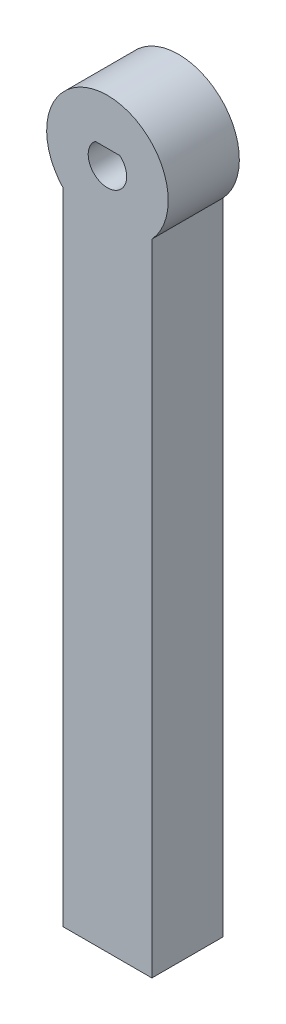
ISO-10303-21;
HEADER;
FILE_DESCRIPTION(('STEP AP214'),'2;1');
FILE_NAME('part.step','',(''),(''),'','','');
FILE_SCHEMA(('AUTOMOTIVE_DESIGN { 1 0 10303 214 1 1 1 1 }'));
ENDSEC;
DATA;
#1=APPLICATION_CONTEXT('core data for automotive mechanical design processes');
#2=APPLICATION_PROTOCOL_DEFINITION('international standard','automotive_design',2000,#1);
#3=PRODUCT_CONTEXT('',#1,'mechanical');
#4=PRODUCT('Part','Part','',(#3));
#5=PRODUCT_RELATED_PRODUCT_CATEGORY('part','',(#4));
#6=PRODUCT_DEFINITION_FORMATION('','',#4);
#7=PRODUCT_DEFINITION_CONTEXT('part definition',#1,'design');
#8=PRODUCT_DEFINITION('design','',#6,#7);
#9=PRODUCT_DEFINITION_SHAPE('','',#8);
#10=(LENGTH_UNIT() NAMED_UNIT(*) SI_UNIT(.MILLI.,.METRE.));
#11=(NAMED_UNIT(*) PLANE_ANGLE_UNIT() SI_UNIT($,.RADIAN.));
#12=(NAMED_UNIT(*) SI_UNIT($,.STERADIAN.) SOLID_ANGLE_UNIT());
#13=UNCERTAINTY_MEASURE_WITH_UNIT(LENGTH_MEASURE(1.E-05),#10,'distance_accuracy_value','');
#14=(GEOMETRIC_REPRESENTATION_CONTEXT(3) GLOBAL_UNCERTAINTY_ASSIGNED_CONTEXT((#13)) GLOBAL_UNIT_ASSIGNED_CONTEXT((#10,
#11,#12)) REPRESENTATION_CONTEXT('',''));
#15=CARTESIAN_POINT('',(0.,0.,0.));
#16=DIRECTION('',(0.,0.,1.));
#17=DIRECTION('',(1.,0.,0.));
#18=AXIS2_PLACEMENT_3D('',#15,#16,#17);
#19=CARTESIAN_POINT('',(-20.4138461538462,65.4861538461538,12.));
#20=DIRECTION('',(0.,0.,-1.));
#21=DIRECTION('',(-1.,0.,0.));
#22=AXIS2_PLACEMENT_3D('',#19,#20,#21);
#23=CYLINDRICAL_SURFACE('',#22,10.2591422643416);
#24=CARTESIAN_POINT('',(-20.4138461538462,65.4861538461538,0.));
#25=DIRECTION('',(0.,0.,1.));
#26=DIRECTION('',(1.,0.,0.));
#27=AXIS2_PLACEMENT_3D('',#24,#25,#26);
#28=CIRCLE('',#27,10.2591422643416);
#29=CARTESIAN_POINT('',(-12.9138461538462,58.4861538461538,0.));
#30=VERTEX_POINT('',#29);
#31=CARTESIAN_POINT('',(-27.9138461538462,58.4861538461538,0.));
#32=VERTEX_POINT('',#31);
#33=EDGE_CURVE('E129',#30,#32,#28,.T.);
#34=ORIENTED_EDGE('',*,*,#33,.T.);
#35=DIRECTION('',(0.,0.,-1.));
#36=VECTOR('',#35,1.);
#37=CARTESIAN_POINT('',(-27.9138461538462,58.4861538461538,12.));
#38=LINE('',#37,#36);
#39=CARTESIAN_POINT('',(-27.9138461538462,58.4861538461538,12.));
#40=VERTEX_POINT('',#39);
#41=EDGE_CURVE('E57',#40,#32,#38,.T.);
#42=ORIENTED_EDGE('',*,*,#41,.F.);
#43=CARTESIAN_POINT('',(-20.4138461538462,65.4861538461538,12.));
#44=DIRECTION('',(0.,0.,1.));
#45=DIRECTION('',(1.,0.,0.));
#46=AXIS2_PLACEMENT_3D('',#43,#44,#45);
#47=CIRCLE('',#46,10.2591422643416);
#48=CARTESIAN_POINT('',(-12.9138461538462,58.4861538461538,12.));
#49=VERTEX_POINT('',#48);
#50=EDGE_CURVE('E125',#49,#40,#47,.T.);
#51=ORIENTED_EDGE('',*,*,#50,.F.);
#52=DIRECTION('',(0.,0.,-1.));
#53=VECTOR('',#52,1.);
#54=CARTESIAN_POINT('',(-12.9138461538462,58.4861538461538,12.));
#55=LINE('',#54,#53);
#56=EDGE_CURVE('E11',#49,#30,#55,.T.);
#57=ORIENTED_EDGE('',*,*,#56,.T.);
#58=EDGE_LOOP('',(#34,#42,#51,#57));
#59=FACE_BOUND('',#58,.T.);
#60=ADVANCED_FACE('F47',(#59),#23,.T.);
#61=CARTESIAN_POINT('',(0.,0.,12.));
#62=DIRECTION('',(0.,0.,1.));
#63=DIRECTION('',(1.,0.,0.));
#64=AXIS2_PLACEMENT_3D('',#61,#62,#63);
#65=PLANE('',#64);
#66=CARTESIAN_POINT('',(-20.4138461538462,65.4861538461538,12.));
#67=DIRECTION('',(0.,0.,1.));
#68=DIRECTION('',(1.,0.,0.));
#69=AXIS2_PLACEMENT_3D('',#66,#67,#68);
#70=CIRCLE('',#69,3.25);
#71=CARTESIAN_POINT('',(-22.4905021195757,67.9861538461538,12.));
#72=VERTEX_POINT('',#71);
#73=CARTESIAN_POINT('',(-18.3371901881166,67.9861538461538,12.));
#74=VERTEX_POINT('',#73);
#75=EDGE_CURVE('E69',#72,#74,#70,.T.);
#76=ORIENTED_EDGE('',*,*,#75,.F.);
#77=DIRECTION('',(1.,0.,0.));
#78=VECTOR('',#77,1.);
#79=CARTESIAN_POINT('',(-22.4905021195757,67.9861538461538,12.));
#80=LINE('',#79,#78);
#81=EDGE_CURVE('E116',#72,#74,#80,.T.);
#82=ORIENTED_EDGE('',*,*,#81,.T.);
#83=EDGE_LOOP('',(#76,#82));
#84=FACE_BOUND('',#83,.T.);
#85=ORIENTED_EDGE('',*,*,#50,.T.);
#86=DIRECTION('',(0.,-1.,0.));
#87=VECTOR('',#86,1.);
#88=CARTESIAN_POINT('',(-27.9138461538462,58.4861538461538,12.));
#89=LINE('',#88,#87);
#90=CARTESIAN_POINT('',(-27.9138461538462,-49.5138461538462,12.));
#91=VERTEX_POINT('',#90);
#92=EDGE_CURVE('E144',#40,#91,#89,.T.);
#93=ORIENTED_EDGE('',*,*,#92,.T.);
#94=DIRECTION('',(1.,0.,0.));
#95=VECTOR('',#94,1.);
#96=CARTESIAN_POINT('',(-27.9138461538462,-49.5138461538462,12.));
#97=LINE('',#96,#95);
#98=CARTESIAN_POINT('',(-12.9138461538462,-49.5138461538462,12.));
#99=VERTEX_POINT('',#98);
#100=EDGE_CURVE('E140',#91,#99,#97,.T.);
#101=ORIENTED_EDGE('',*,*,#100,.T.);
#102=DIRECTION('',(0.,-1.,0.));
#103=VECTOR('',#102,1.);
#104=CARTESIAN_POINT('',(-12.9138461538462,58.4861538461538,12.));
#105=LINE('',#104,#103);
#106=EDGE_CURVE('E136',#49,#99,#105,.T.);
#107=ORIENTED_EDGE('',*,*,#106,.F.);
#108=EDGE_LOOP('',(#85,#93,#101,#107));
#109=FACE_BOUND('',#108,.T.);
#110=ADVANCED_FACE('F175',(#84,#109),#65,.T.);
#111=CARTESIAN_POINT('',(0.,0.,0.));
#112=DIRECTION('',(0.,0.,1.));
#113=DIRECTION('',(1.,0.,0.));
#114=AXIS2_PLACEMENT_3D('',#111,#112,#113);
#115=PLANE('',#114);
#116=ORIENTED_EDGE('',*,*,#33,.F.);
#117=DIRECTION('',(0.,-1.,0.));
#118=VECTOR('',#117,1.);
#119=CARTESIAN_POINT('',(-12.9138461538462,58.4861538461538,0.));
#120=LINE('',#119,#118);
#121=CARTESIAN_POINT('',(-12.9138461538462,-49.5138461538462,0.));
#122=VERTEX_POINT('',#121);
#123=EDGE_CURVE('E105',#30,#122,#120,.T.);
#124=ORIENTED_EDGE('',*,*,#123,.T.);
#125=DIRECTION('',(1.,0.,0.));
#126=VECTOR('',#125,1.);
#127=CARTESIAN_POINT('',(-27.9138461538462,-49.5138461538462,0.));
#128=LINE('',#127,#126);
#129=CARTESIAN_POINT('',(-27.9138461538462,-49.5138461538462,0.));
#130=VERTEX_POINT('',#129);
#131=EDGE_CURVE('E150',#130,#122,#128,.T.);
#132=ORIENTED_EDGE('',*,*,#131,.F.);
#133=DIRECTION('',(0.,-1.,0.));
#134=VECTOR('',#133,1.);
#135=CARTESIAN_POINT('',(-27.9138461538462,58.4861538461538,0.));
#136=LINE('',#135,#134);
#137=EDGE_CURVE('E141',#32,#130,#136,.T.);
#138=ORIENTED_EDGE('',*,*,#137,.F.);
#139=EDGE_LOOP('',(#116,#124,#132,#138));
#140=FACE_BOUND('',#139,.T.);
#141=ADVANCED_FACE('F170',(#140),#115,.F.);
#142=CARTESIAN_POINT('',(-27.9138461538462,58.4861538461538,12.));
#143=DIRECTION('',(1.,0.,0.));
#144=DIRECTION('',(0.,0.,-1.));
#145=AXIS2_PLACEMENT_3D('',#142,#143,#144);
#146=PLANE('',#145);
#147=ORIENTED_EDGE('',*,*,#137,.T.);
#148=DIRECTION('',(0.,0.,-1.));
#149=VECTOR('',#148,1.);
#150=CARTESIAN_POINT('',(-27.9138461538462,-49.5138461538462,12.));
#151=LINE('',#150,#149);
#152=EDGE_CURVE('E133',#91,#130,#151,.T.);
#153=ORIENTED_EDGE('',*,*,#152,.F.);
#154=ORIENTED_EDGE('',*,*,#92,.F.);
#155=ORIENTED_EDGE('',*,*,#41,.T.);
#156=EDGE_LOOP('',(#147,#153,#154,#155));
#157=FACE_BOUND('',#156,.T.);
#158=ADVANCED_FACE('F177',(#157),#146,.F.);
#159=CARTESIAN_POINT('',(-27.9138461538462,-49.5138461538462,12.));
#160=DIRECTION('',(0.,1.,0.));
#161=DIRECTION('',(-1.,0.,0.));
#162=AXIS2_PLACEMENT_3D('',#159,#160,#161);
#163=PLANE('',#162);
#164=ORIENTED_EDGE('',*,*,#131,.T.);
#165=DIRECTION('',(0.,0.,-1.));
#166=VECTOR('',#165,1.);
#167=CARTESIAN_POINT('',(-12.9138461538462,-49.5138461538462,12.));
#168=LINE('',#167,#166);
#169=EDGE_CURVE('E51',#99,#122,#168,.T.);
#170=ORIENTED_EDGE('',*,*,#169,.F.);
#171=ORIENTED_EDGE('',*,*,#100,.F.);
#172=ORIENTED_EDGE('',*,*,#152,.T.);
#173=EDGE_LOOP('',(#164,#170,#171,#172));
#174=FACE_BOUND('',#173,.T.);
#175=ADVANCED_FACE('F167',(#174),#163,.F.);
#176=CARTESIAN_POINT('',(-12.9138461538462,58.4861538461538,12.));
#177=DIRECTION('',(1.,0.,0.));
#178=DIRECTION('',(0.,1.,0.));
#179=AXIS2_PLACEMENT_3D('',#176,#177,#178);
#180=PLANE('',#179);
#181=ORIENTED_EDGE('',*,*,#123,.F.);
#182=ORIENTED_EDGE('',*,*,#56,.F.);
#183=ORIENTED_EDGE('',*,*,#106,.T.);
#184=ORIENTED_EDGE('',*,*,#169,.T.);
#185=EDGE_LOOP('',(#181,#182,#183,#184));
#186=FACE_BOUND('',#185,.T.);
#187=ADVANCED_FACE('F49',(#186),#180,.T.);
#188=CARTESIAN_POINT('',(-20.4138461538462,65.4861538461538,3.));
#189=DIRECTION('',(0.,0.,1.));
#190=DIRECTION('',(1.,0.,0.));
#191=AXIS2_PLACEMENT_3D('',#188,#189,#190);
#192=CYLINDRICAL_SURFACE('',#191,3.25);
#193=ORIENTED_EDGE('',*,*,#75,.T.);
#194=DIRECTION('',(0.,0.,1.));
#195=VECTOR('',#194,1.);
#196=CARTESIAN_POINT('',(-18.3371901881166,67.9861538461538,3.));
#197=LINE('',#196,#195);
#198=CARTESIAN_POINT('',(-18.3371901881166,67.9861538461538,3.));
#199=VERTEX_POINT('',#198);
#200=EDGE_CURVE('E107',#199,#74,#197,.T.);
#201=ORIENTED_EDGE('',*,*,#200,.F.);
#202=CARTESIAN_POINT('',(-20.4138461538462,65.4861538461538,3.));
#203=DIRECTION('',(0.,0.,1.));
#204=DIRECTION('',(1.,0.,0.));
#205=AXIS2_PLACEMENT_3D('',#202,#203,#204);
#206=CIRCLE('',#205,3.25);
#207=CARTESIAN_POINT('',(-22.4905021195757,67.9861538461538,3.));
#208=VERTEX_POINT('',#207);
#209=EDGE_CURVE('E100',#208,#199,#206,.T.);
#210=ORIENTED_EDGE('',*,*,#209,.F.);
#211=DIRECTION('',(0.,0.,1.));
#212=VECTOR('',#211,1.);
#213=CARTESIAN_POINT('',(-22.4905021195757,67.9861538461538,3.));
#214=LINE('',#213,#212);
#215=EDGE_CURVE('E65',#208,#72,#214,.T.);
#216=ORIENTED_EDGE('',*,*,#215,.T.);
#217=EDGE_LOOP('',(#193,#201,#210,#216));
#218=FACE_BOUND('',#217,.T.);
#219=ADVANCED_FACE('F108',(#218),#192,.F.);
#220=CARTESIAN_POINT('',(-20.4138461538462,65.4861538461538,3.));
#221=DIRECTION('',(0.,0.,1.));
#222=DIRECTION('',(1.,0.,0.));
#223=AXIS2_PLACEMENT_3D('',#220,#221,#222);
#224=PLANE('',#223);
#225=DIRECTION('',(1.,0.,0.));
#226=VECTOR('',#225,1.);
#227=CARTESIAN_POINT('',(-22.4905021195757,67.9861538461538,3.));
#228=LINE('',#227,#226);
#229=EDGE_CURVE('E103',#208,#199,#228,.T.);
#230=ORIENTED_EDGE('',*,*,#229,.F.);
#231=ORIENTED_EDGE('',*,*,#209,.T.);
#232=EDGE_LOOP('',(#230,#231));
#233=FACE_BOUND('',#232,.T.);
#234=ADVANCED_FACE('F101',(#233),#224,.T.);
#235=CARTESIAN_POINT('',(-22.4905021195757,67.9861538461538,3.));
#236=DIRECTION('',(0.,-1.,0.));
#237=DIRECTION('',(0.,0.,-1.));
#238=AXIS2_PLACEMENT_3D('',#235,#236,#237);
#239=PLANE('',#238);
#240=ORIENTED_EDGE('',*,*,#81,.F.);
#241=ORIENTED_EDGE('',*,*,#215,.F.);
#242=ORIENTED_EDGE('',*,*,#229,.T.);
#243=ORIENTED_EDGE('',*,*,#200,.T.);
#244=EDGE_LOOP('',(#240,#241,#242,#243));
#245=FACE_BOUND('',#244,.T.);
#246=ADVANCED_FACE('F114',(#245),#239,.T.);
#247=CLOSED_SHELL('',(#60,#110,#141,#158,#175,#187,#219,#234,#246));
#248=MANIFOLD_SOLID_BREP('B2',#247);
#249=ADVANCED_BREP_SHAPE_REPRESENTATION('',(#18,#248),#14);
#250=SHAPE_DEFINITION_REPRESENTATION(#9,#249);
ENDSEC;
END-ISO-10303-21;
